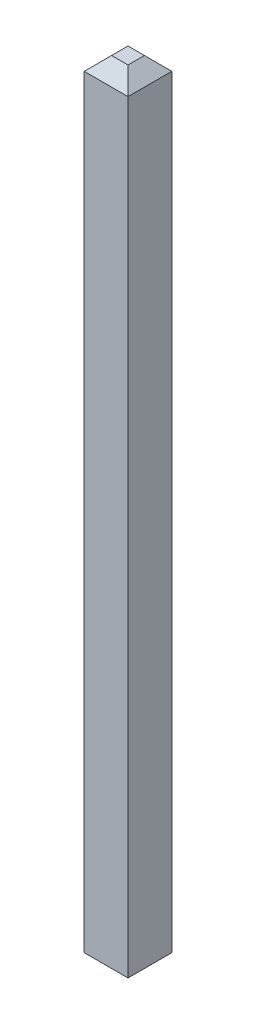
ISO-10303-21;
HEADER;
FILE_DESCRIPTION(('STEP AP214'),'2;1');
FILE_NAME('part.step','',(''),(''),'','','');
FILE_SCHEMA(('AUTOMOTIVE_DESIGN { 1 0 10303 214 1 1 1 1 }'));
ENDSEC;
DATA;
#1=APPLICATION_CONTEXT('core data for automotive mechanical design processes');
#2=APPLICATION_PROTOCOL_DEFINITION('international standard','automotive_design',2000,#1);
#3=PRODUCT_CONTEXT('',#1,'mechanical');
#4=PRODUCT('Part','Part','',(#3));
#5=PRODUCT_RELATED_PRODUCT_CATEGORY('part','',(#4));
#6=PRODUCT_DEFINITION_FORMATION('','',#4);
#7=PRODUCT_DEFINITION_CONTEXT('part definition',#1,'design');
#8=PRODUCT_DEFINITION('design','',#6,#7);
#9=PRODUCT_DEFINITION_SHAPE('','',#8);
#10=(LENGTH_UNIT() NAMED_UNIT(*) SI_UNIT(.MILLI.,.METRE.));
#11=(NAMED_UNIT(*) PLANE_ANGLE_UNIT() SI_UNIT($,.RADIAN.));
#12=(NAMED_UNIT(*) SI_UNIT($,.STERADIAN.) SOLID_ANGLE_UNIT());
#13=UNCERTAINTY_MEASURE_WITH_UNIT(LENGTH_MEASURE(1.E-05),#10,'distance_accuracy_value','');
#14=(GEOMETRIC_REPRESENTATION_CONTEXT(3) GLOBAL_UNCERTAINTY_ASSIGNED_CONTEXT((#13)) GLOBAL_UNIT_ASSIGNED_CONTEXT((#10,
#11,#12)) REPRESENTATION_CONTEXT('',''));
#15=CARTESIAN_POINT('',(0.,0.,0.));
#16=DIRECTION('',(0.,0.,1.));
#17=DIRECTION('',(1.,0.,0.));
#18=AXIS2_PLACEMENT_3D('',#15,#16,#17);
#19=CARTESIAN_POINT('',(1.59,7.07,-0.32));
#20=DIRECTION('',(-0.707106781186548,-0.707106781186548,0.));
#21=DIRECTION('',(-0.707106781186548,0.707106781186548,0.));
#22=AXIS2_PLACEMENT_3D('',#19,#20,#21);
#23=PLANE('',#22);
#24=DIRECTION('',(0.577350269189626,-0.577350269189626,0.577350269189626));
#25=VECTOR('',#24,1.);
#26=CARTESIAN_POINT('',(1.376666666667,7.283333333333,0.106666666667));
#27=LINE('',#26,#25);
#28=CARTESIAN_POINT('',(1.39,7.27,0.12));
#29=VERTEX_POINT('',#28);
#30=CARTESIAN_POINT('',(1.59,7.07,0.32));
#31=VERTEX_POINT('',#30);
#32=EDGE_CURVE('E64',#29,#31,#27,.T.);
#33=ORIENTED_EDGE('',*,*,#32,.T.);
#34=DIRECTION('',(0.,0.,1.));
#35=VECTOR('',#34,1.);
#36=CARTESIAN_POINT('',(1.59,7.07,-0.32));
#37=LINE('',#36,#35);
#38=CARTESIAN_POINT('',(1.59,7.07,-0.32));
#39=VERTEX_POINT('',#38);
#40=EDGE_CURVE('E77',#39,#31,#37,.T.);
#41=ORIENTED_EDGE('',*,*,#40,.F.);
#42=DIRECTION('',(0.577350269189626,-0.577350269189626,-0.577350269189626));
#43=VECTOR('',#42,1.);
#44=CARTESIAN_POINT('',(1.59,7.07,-0.32));
#45=LINE('',#44,#43);
#46=CARTESIAN_POINT('',(1.39,7.27,-0.12));
#47=VERTEX_POINT('',#46);
#48=EDGE_CURVE('E11',#47,#39,#45,.T.);
#49=ORIENTED_EDGE('',*,*,#48,.F.);
#50=DIRECTION('',(0.,0.,-1.));
#51=VECTOR('',#50,1.);
#52=CARTESIAN_POINT('',(1.39,7.27,-0.32));
#53=LINE('',#52,#51);
#54=EDGE_CURVE('E74',#29,#47,#53,.T.);
#55=ORIENTED_EDGE('',*,*,#54,.F.);
#56=EDGE_LOOP('',(#33,#41,#49,#55));
#57=FACE_BOUND('',#56,.T.);
#58=ADVANCED_FACE('F17',(#57),#23,.F.);
#59=CARTESIAN_POINT('',(1.27,7.07,-0.32));
#60=DIRECTION('',(0.,0.707106781186548,-0.707106781186548));
#61=DIRECTION('',(-1.,0.,0.));
#62=AXIS2_PLACEMENT_3D('',#59,#60,#61);
#63=PLANE('',#62);
#64=DIRECTION('',(0.577350269189626,0.577350269189626,0.577350269189626));
#65=VECTOR('',#64,1.);
#66=CARTESIAN_POINT('',(1.083333333333,7.203333333333,-0.186666666667));
#67=LINE('',#66,#65);
#68=CARTESIAN_POINT('',(0.95,7.07,-0.32));
#69=VERTEX_POINT('',#68);
#70=CARTESIAN_POINT('',(1.15,7.27,-0.12));
#71=VERTEX_POINT('',#70);
#72=EDGE_CURVE('E26',#69,#71,#67,.T.);
#73=ORIENTED_EDGE('',*,*,#72,.T.);
#74=DIRECTION('',(-1.,0.,0.));
#75=VECTOR('',#74,1.);
#76=CARTESIAN_POINT('',(0.95,7.27,-0.12));
#77=LINE('',#76,#75);
#78=EDGE_CURVE('E82',#47,#71,#77,.T.);
#79=ORIENTED_EDGE('',*,*,#78,.F.);
#80=ORIENTED_EDGE('',*,*,#48,.T.);
#81=DIRECTION('',(1.,0.,0.));
#82=VECTOR('',#81,1.);
#83=CARTESIAN_POINT('',(1.59,7.07,-0.32));
#84=LINE('',#83,#82);
#85=EDGE_CURVE('E194',#69,#39,#84,.T.);
#86=ORIENTED_EDGE('',*,*,#85,.F.);
#87=EDGE_LOOP('',(#73,#79,#80,#86));
#88=FACE_BOUND('',#87,.T.);
#89=ADVANCED_FACE('F83',(#88),#63,.T.);
#90=CARTESIAN_POINT('',(1.15,7.27,-0.32));
#91=DIRECTION('',(0.707106781186548,-0.707106781186548,0.));
#92=DIRECTION('',(0.,0.,-1.));
#93=AXIS2_PLACEMENT_3D('',#90,#91,#92);
#94=PLANE('',#93);
#95=DIRECTION('',(-0.577350269189626,-0.577350269189626,0.577350269189626));
#96=VECTOR('',#95,1.);
#97=CARTESIAN_POINT('',(1.083333333333,7.203333333333,0.186666666667));
#98=LINE('',#97,#96);
#99=CARTESIAN_POINT('',(1.15,7.27,0.12));
#100=VERTEX_POINT('',#99);
#101=CARTESIAN_POINT('',(0.95,7.07,0.32));
#102=VERTEX_POINT('',#101);
#103=EDGE_CURVE('E39',#100,#102,#98,.T.);
#104=ORIENTED_EDGE('',*,*,#103,.F.);
#105=DIRECTION('',(0.,0.,1.));
#106=VECTOR('',#105,1.);
#107=CARTESIAN_POINT('',(1.15,7.27,-0.32));
#108=LINE('',#107,#106);
#109=EDGE_CURVE('E88',#71,#100,#108,.T.);
#110=ORIENTED_EDGE('',*,*,#109,.F.);
#111=ORIENTED_EDGE('',*,*,#72,.F.);
#112=DIRECTION('',(0.,0.,-1.));
#113=VECTOR('',#112,1.);
#114=CARTESIAN_POINT('',(0.95,7.07,-0.32));
#115=LINE('',#114,#113);
#116=EDGE_CURVE('E173',#102,#69,#115,.T.);
#117=ORIENTED_EDGE('',*,*,#116,.F.);
#118=EDGE_LOOP('',(#104,#110,#111,#117));
#119=FACE_BOUND('',#118,.T.);
#120=ADVANCED_FACE('F317',(#119),#94,.F.);
#121=CARTESIAN_POINT('',(0.95,7.27,0.12));
#122=DIRECTION('',(0.,-0.707106781186548,-0.707106781186548));
#123=DIRECTION('',(0.,-0.707106781186548,0.707106781186548));
#124=AXIS2_PLACEMENT_3D('',#121,#122,#123);
#125=PLANE('',#124);
#126=ORIENTED_EDGE('',*,*,#32,.F.);
#127=DIRECTION('',(1.,0.,0.));
#128=VECTOR('',#127,1.);
#129=CARTESIAN_POINT('',(0.95,7.27,0.12));
#130=LINE('',#129,#128);
#131=EDGE_CURVE('E91',#100,#29,#130,.T.);
#132=ORIENTED_EDGE('',*,*,#131,.F.);
#133=ORIENTED_EDGE('',*,*,#103,.T.);
#134=DIRECTION('',(-1.,0.,0.));
#135=VECTOR('',#134,1.);
#136=CARTESIAN_POINT('',(1.27,7.07,0.32));
#137=LINE('',#136,#135);
#138=EDGE_CURVE('E98',#31,#102,#137,.T.);
#139=ORIENTED_EDGE('',*,*,#138,.F.);
#140=EDGE_LOOP('',(#126,#132,#133,#139));
#141=FACE_BOUND('',#140,.T.);
#142=ADVANCED_FACE('F319',(#141),#125,.F.);
#143=CARTESIAN_POINT('',(0.95,7.27,-0.32));
#144=DIRECTION('',(0.,-1.,0.));
#145=DIRECTION('',(0.,0.,-1.));
#146=AXIS2_PLACEMENT_3D('',#143,#144,#145);
#147=PLANE('',#146);
#148=ORIENTED_EDGE('',*,*,#54,.T.);
#149=ORIENTED_EDGE('',*,*,#78,.T.);
#150=ORIENTED_EDGE('',*,*,#109,.T.);
#151=ORIENTED_EDGE('',*,*,#131,.T.);
#152=EDGE_LOOP('',(#148,#149,#150,#151));
#153=FACE_BOUND('',#152,.T.);
#154=ADVANCED_FACE('F90',(#153),#147,.F.);
#155=CARTESIAN_POINT('',(1.59,7.27,-0.32));
#156=DIRECTION('',(-1.,0.,0.));
#157=DIRECTION('',(0.,1.,0.));
#158=AXIS2_PLACEMENT_3D('',#155,#156,#157);
#159=PLANE('',#158);
#160=DIRECTION('',(0.,-1.,0.));
#161=VECTOR('',#160,1.);
#162=CARTESIAN_POINT('',(1.59,7.27,-0.32));
#163=LINE('',#162,#161);
#164=CARTESIAN_POINT('',(1.59,-4.07,-0.32));
#165=VERTEX_POINT('',#164);
#166=EDGE_CURVE('E189',#39,#165,#163,.T.);
#167=ORIENTED_EDGE('',*,*,#166,.F.);
#168=ORIENTED_EDGE('',*,*,#40,.T.);
#169=DIRECTION('',(0.,-1.,0.));
#170=VECTOR('',#169,1.);
#171=CARTESIAN_POINT('',(1.59,7.27,0.32));
#172=LINE('',#171,#170);
#173=CARTESIAN_POINT('',(1.59,-4.07,0.32));
#174=VERTEX_POINT('',#173);
#175=EDGE_CURVE('E143',#31,#174,#172,.T.);
#176=ORIENTED_EDGE('',*,*,#175,.T.);
#177=DIRECTION('',(0.,0.,-1.));
#178=VECTOR('',#177,1.);
#179=CARTESIAN_POINT('',(1.59,-4.07,-0.32));
#180=LINE('',#179,#178);
#181=EDGE_CURVE('E148',#174,#165,#180,.T.);
#182=ORIENTED_EDGE('',*,*,#181,.T.);
#183=EDGE_LOOP('',(#167,#168,#176,#182));
#184=FACE_BOUND('',#183,.T.);
#185=ADVANCED_FACE('F308',(#184),#159,.F.);
#186=CARTESIAN_POINT('',(1.27,1.5,0.32));
#187=DIRECTION('',(0.,0.,-1.));
#188=DIRECTION('',(0.,-1.,0.));
#189=AXIS2_PLACEMENT_3D('',#186,#187,#188);
#190=PLANE('',#189);
#191=ORIENTED_EDGE('',*,*,#175,.F.);
#192=ORIENTED_EDGE('',*,*,#138,.T.);
#193=DIRECTION('',(0.,1.,0.));
#194=VECTOR('',#193,1.);
#195=CARTESIAN_POINT('',(0.95,-4.27,0.32));
#196=LINE('',#195,#194);
#197=CARTESIAN_POINT('',(0.95,-4.07,0.32));
#198=VERTEX_POINT('',#197);
#199=EDGE_CURVE('E179',#198,#102,#196,.T.);
#200=ORIENTED_EDGE('',*,*,#199,.F.);
#201=DIRECTION('',(1.,0.,0.));
#202=VECTOR('',#201,1.);
#203=CARTESIAN_POINT('',(1.27,-4.07,0.32));
#204=LINE('',#203,#202);
#205=EDGE_CURVE('E155',#198,#174,#204,.T.);
#206=ORIENTED_EDGE('',*,*,#205,.T.);
#207=EDGE_LOOP('',(#191,#192,#200,#206));
#208=FACE_BOUND('',#207,.T.);
#209=ADVANCED_FACE('F372',(#208),#190,.F.);
#210=CARTESIAN_POINT('',(1.39,-4.27,-0.32));
#211=DIRECTION('',(-0.707106781186548,0.707106781186548,0.));
#212=DIRECTION('',(0.,0.,1.));
#213=AXIS2_PLACEMENT_3D('',#210,#211,#212);
#214=PLANE('',#213);
#215=DIRECTION('',(-0.577350269189626,-0.577350269189626,0.577350269189626));
#216=VECTOR('',#215,1.);
#217=CARTESIAN_POINT('',(1.456666666667,-4.203333333333,-0.186666666667));
#218=LINE('',#217,#216);
#219=CARTESIAN_POINT('',(1.39,-4.27,-0.12));
#220=VERTEX_POINT('',#219);
#221=EDGE_CURVE('E205',#165,#220,#218,.T.);
#222=ORIENTED_EDGE('',*,*,#221,.F.);
#223=ORIENTED_EDGE('',*,*,#181,.F.);
#224=DIRECTION('',(-0.577350269189626,-0.577350269189626,-0.577350269189626));
#225=VECTOR('',#224,1.);
#226=CARTESIAN_POINT('',(1.243333333333,-4.416666666667,-0.02666666666667));
#227=LINE('',#226,#225);
#228=CARTESIAN_POINT('',(1.39,-4.27,0.12));
#229=VERTEX_POINT('',#228);
#230=EDGE_CURVE('E162',#174,#229,#227,.T.);
#231=ORIENTED_EDGE('',*,*,#230,.T.);
#232=DIRECTION('',(0.,0.,1.));
#233=VECTOR('',#232,1.);
#234=CARTESIAN_POINT('',(1.39,-4.27,-0.32));
#235=LINE('',#234,#233);
#236=EDGE_CURVE('E255',#220,#229,#235,.T.);
#237=ORIENTED_EDGE('',*,*,#236,.F.);
#238=EDGE_LOOP('',(#222,#223,#231,#237));
#239=FACE_BOUND('',#238,.T.);
#240=ADVANCED_FACE('F280',(#239),#214,.F.);
#241=CARTESIAN_POINT('',(1.59,-4.27,0.12));
#242=DIRECTION('',(0.,0.707106781186548,-0.707106781186548));
#243=DIRECTION('',(-1.,0.,0.));
#244=AXIS2_PLACEMENT_3D('',#241,#242,#243);
#245=PLANE('',#244);
#246=ORIENTED_EDGE('',*,*,#230,.F.);
#247=ORIENTED_EDGE('',*,*,#205,.F.);
#248=DIRECTION('',(-0.577350269189626,0.577350269189626,0.577350269189626));
#249=VECTOR('',#248,1.);
#250=CARTESIAN_POINT('',(1.163333333333,-4.283333333333,0.106666666667));
#251=LINE('',#250,#249);
#252=CARTESIAN_POINT('',(1.15,-4.27,0.12));
#253=VERTEX_POINT('',#252);
#254=EDGE_CURVE('E169',#253,#198,#251,.T.);
#255=ORIENTED_EDGE('',*,*,#254,.F.);
#256=DIRECTION('',(-1.,0.,0.));
#257=VECTOR('',#256,1.);
#258=CARTESIAN_POINT('',(1.59,-4.27,0.12));
#259=LINE('',#258,#257);
#260=EDGE_CURVE('E243',#229,#253,#259,.T.);
#261=ORIENTED_EDGE('',*,*,#260,.F.);
#262=EDGE_LOOP('',(#246,#247,#255,#261));
#263=FACE_BOUND('',#262,.T.);
#264=ADVANCED_FACE('F392',(#263),#245,.F.);
#265=CARTESIAN_POINT('',(0.95,-4.07,-0.32));
#266=DIRECTION('',(0.707106781186548,0.707106781186548,0.));
#267=DIRECTION('',(0.,0.,-1.));
#268=AXIS2_PLACEMENT_3D('',#265,#266,#267);
#269=PLANE('',#268);
#270=DIRECTION('',(0.577350269189626,-0.577350269189626,0.577350269189626));
#271=VECTOR('',#270,1.);
#272=CARTESIAN_POINT('',(1.056666666667,-4.176666666667,-0.213333333333));
#273=LINE('',#272,#271);
#274=CARTESIAN_POINT('',(0.95,-4.07,-0.32));
#275=VERTEX_POINT('',#274);
#276=CARTESIAN_POINT('',(1.15,-4.27,-0.12));
#277=VERTEX_POINT('',#276);
#278=EDGE_CURVE('E214',#275,#277,#273,.T.);
#279=ORIENTED_EDGE('',*,*,#278,.T.);
#280=DIRECTION('',(0.,0.,-1.));
#281=VECTOR('',#280,1.);
#282=CARTESIAN_POINT('',(1.15,-4.27,-0.32));
#283=LINE('',#282,#281);
#284=EDGE_CURVE('E231',#253,#277,#283,.T.);
#285=ORIENTED_EDGE('',*,*,#284,.F.);
#286=ORIENTED_EDGE('',*,*,#254,.T.);
#287=DIRECTION('',(0.,0.,1.));
#288=VECTOR('',#287,1.);
#289=CARTESIAN_POINT('',(0.95,-4.07,-0.32));
#290=LINE('',#289,#288);
#291=EDGE_CURVE('E178',#275,#198,#290,.T.);
#292=ORIENTED_EDGE('',*,*,#291,.F.);
#293=EDGE_LOOP('',(#279,#285,#286,#292));
#294=FACE_BOUND('',#293,.T.);
#295=ADVANCED_FACE('F402',(#294),#269,.F.);
#296=CARTESIAN_POINT('',(0.95,-4.27,-0.32));
#297=DIRECTION('',(1.,0.,0.));
#298=DIRECTION('',(0.,0.,1.));
#299=AXIS2_PLACEMENT_3D('',#296,#297,#298);
#300=PLANE('',#299);
#301=ORIENTED_EDGE('',*,*,#199,.T.);
#302=ORIENTED_EDGE('',*,*,#116,.T.);
#303=DIRECTION('',(0.,1.,0.));
#304=VECTOR('',#303,1.);
#305=CARTESIAN_POINT('',(0.95,-4.27,-0.32));
#306=LINE('',#305,#304);
#307=EDGE_CURVE('E201',#275,#69,#306,.T.);
#308=ORIENTED_EDGE('',*,*,#307,.F.);
#309=ORIENTED_EDGE('',*,*,#291,.T.);
#310=EDGE_LOOP('',(#301,#302,#308,#309));
#311=FACE_BOUND('',#310,.T.);
#312=ADVANCED_FACE('F315',(#311),#300,.F.);
#313=CARTESIAN_POINT('',(1.27,1.5,-0.32));
#314=DIRECTION('',(0.,0.,-1.));
#315=DIRECTION('',(0.,-1.,0.));
#316=AXIS2_PLACEMENT_3D('',#313,#314,#315);
#317=PLANE('',#316);
#318=ORIENTED_EDGE('',*,*,#307,.T.);
#319=ORIENTED_EDGE('',*,*,#85,.T.);
#320=ORIENTED_EDGE('',*,*,#166,.T.);
#321=DIRECTION('',(-1.,0.,0.));
#322=VECTOR('',#321,1.);
#323=CARTESIAN_POINT('',(0.95,-4.07,-0.32));
#324=LINE('',#323,#322);
#325=EDGE_CURVE('E210',#165,#275,#324,.T.);
#326=ORIENTED_EDGE('',*,*,#325,.T.);
#327=EDGE_LOOP('',(#318,#319,#320,#326));
#328=FACE_BOUND('',#327,.T.);
#329=ADVANCED_FACE('F311',(#328),#317,.T.);
#330=CARTESIAN_POINT('',(1.27,-4.07,-0.32));
#331=DIRECTION('',(0.,-0.707106781186548,-0.707106781186548));
#332=DIRECTION('',(0.,-0.707106781186548,0.707106781186548));
#333=AXIS2_PLACEMENT_3D('',#330,#331,#332);
#334=PLANE('',#333);
#335=ORIENTED_EDGE('',*,*,#278,.F.);
#336=ORIENTED_EDGE('',*,*,#325,.F.);
#337=ORIENTED_EDGE('',*,*,#221,.T.);
#338=DIRECTION('',(1.,0.,0.));
#339=VECTOR('',#338,1.);
#340=CARTESIAN_POINT('',(1.59,-4.27,-0.12));
#341=LINE('',#340,#339);
#342=EDGE_CURVE('E219',#277,#220,#341,.T.);
#343=ORIENTED_EDGE('',*,*,#342,.F.);
#344=EDGE_LOOP('',(#335,#336,#337,#343));
#345=FACE_BOUND('',#344,.T.);
#346=ADVANCED_FACE('F432',(#345),#334,.T.);
#347=CARTESIAN_POINT('',(1.59,-4.27,-0.32));
#348=DIRECTION('',(0.,1.,0.));
#349=DIRECTION('',(0.,0.,-1.));
#350=AXIS2_PLACEMENT_3D('',#347,#348,#349);
#351=PLANE('',#350);
#352=ORIENTED_EDGE('',*,*,#236,.T.);
#353=ORIENTED_EDGE('',*,*,#260,.T.);
#354=ORIENTED_EDGE('',*,*,#284,.T.);
#355=ORIENTED_EDGE('',*,*,#342,.T.);
#356=EDGE_LOOP('',(#352,#353,#354,#355));
#357=FACE_BOUND('',#356,.T.);
#358=ADVANCED_FACE('F271',(#357),#351,.F.);
#359=CLOSED_SHELL('',(#58,#89,#120,#142,#154,#185,#209,#240,#264,#295,#312,#329,#346,#358));
#360=MANIFOLD_SOLID_BREP('B1',#359);
#361=ADVANCED_BREP_SHAPE_REPRESENTATION('',(#18,#360),#14);
#362=SHAPE_DEFINITION_REPRESENTATION(#9,#361);
ENDSEC;
END-ISO-10303-21;
